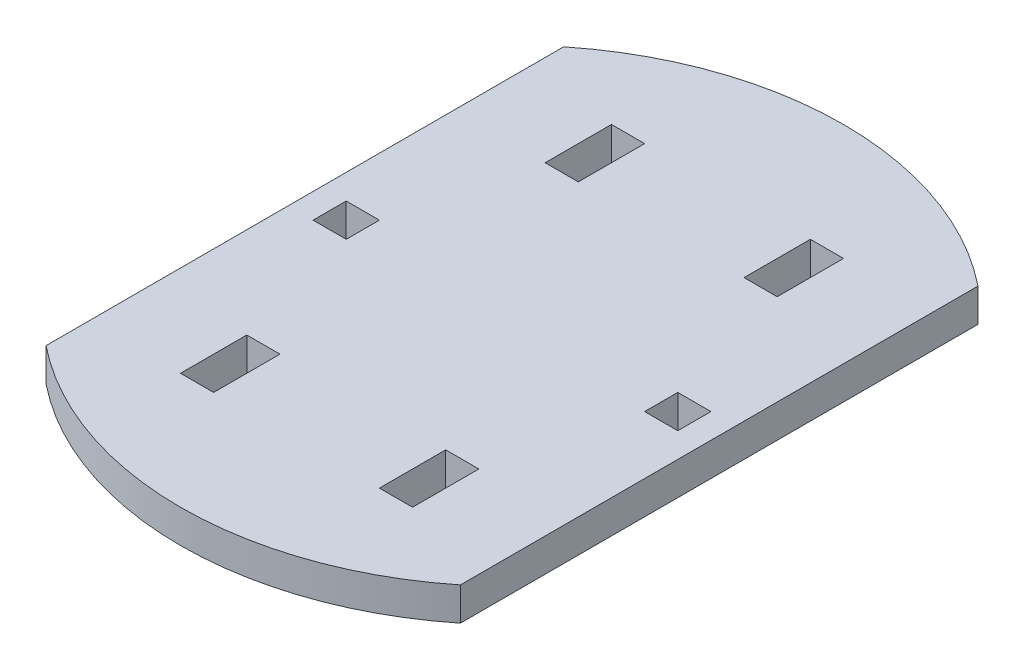
ISO-10303-21;
HEADER;
FILE_DESCRIPTION(('STEP AP214'),'2;1');
FILE_NAME('part.step','',(''),(''),'','','');
FILE_SCHEMA(('AUTOMOTIVE_DESIGN { 1 0 10303 214 1 1 1 1 }'));
ENDSEC;
DATA;
#1=APPLICATION_CONTEXT('core data for automotive mechanical design processes');
#2=APPLICATION_PROTOCOL_DEFINITION('international standard','automotive_design',2000,#1);
#3=PRODUCT_CONTEXT('',#1,'mechanical');
#4=PRODUCT('Part','Part','',(#3));
#5=PRODUCT_RELATED_PRODUCT_CATEGORY('part','',(#4));
#6=PRODUCT_DEFINITION_FORMATION('','',#4);
#7=PRODUCT_DEFINITION_CONTEXT('part definition',#1,'design');
#8=PRODUCT_DEFINITION('design','',#6,#7);
#9=PRODUCT_DEFINITION_SHAPE('','',#8);
#10=(LENGTH_UNIT() NAMED_UNIT(*) SI_UNIT(.MILLI.,.METRE.));
#11=(NAMED_UNIT(*) PLANE_ANGLE_UNIT() SI_UNIT($,.RADIAN.));
#12=(NAMED_UNIT(*) SI_UNIT($,.STERADIAN.) SOLID_ANGLE_UNIT());
#13=UNCERTAINTY_MEASURE_WITH_UNIT(LENGTH_MEASURE(1.E-05),#10,'distance_accuracy_value','');
#14=(GEOMETRIC_REPRESENTATION_CONTEXT(3) GLOBAL_UNCERTAINTY_ASSIGNED_CONTEXT((#13)) GLOBAL_UNIT_ASSIGNED_CONTEXT((#10,
#11,#12)) REPRESENTATION_CONTEXT('',''));
#15=CARTESIAN_POINT('',(0.,0.,0.));
#16=DIRECTION('',(0.,0.,1.));
#17=DIRECTION('',(1.,0.,0.));
#18=AXIS2_PLACEMENT_3D('',#15,#16,#17);
#19=CARTESIAN_POINT('',(25.,4.,0.));
#20=DIRECTION('',(1.,0.,0.));
#21=DIRECTION('',(0.,0.,-1.));
#22=AXIS2_PLACEMENT_3D('',#19,#20,#21);
#23=PLANE('',#22);
#24=DIRECTION('',(0.,0.,1.));
#25=VECTOR('',#24,1.);
#26=CARTESIAN_POINT('',(25.,0.,0.));
#27=LINE('',#26,#25);
#28=CARTESIAN_POINT('',(25.,0.,-31.224989991992));
#29=VERTEX_POINT('',#28);
#30=CARTESIAN_POINT('',(25.,0.,31.224989991992));
#31=VERTEX_POINT('',#30);
#32=EDGE_CURVE('E388',#29,#31,#27,.T.);
#33=ORIENTED_EDGE('',*,*,#32,.F.);
#34=DIRECTION('',(0.,-1.,0.));
#35=VECTOR('',#34,1.);
#36=CARTESIAN_POINT('',(25.,4.,-31.224989991992));
#37=LINE('',#36,#35);
#38=CARTESIAN_POINT('',(25.,4.,-31.224989991992));
#39=VERTEX_POINT('',#38);
#40=EDGE_CURVE('E11',#39,#29,#37,.T.);
#41=ORIENTED_EDGE('',*,*,#40,.F.);
#42=DIRECTION('',(0.,0.,1.));
#43=VECTOR('',#42,1.);
#44=CARTESIAN_POINT('',(25.,4.,0.));
#45=LINE('',#44,#43);
#46=CARTESIAN_POINT('',(25.,4.,31.224989991992));
#47=VERTEX_POINT('',#46);
#48=EDGE_CURVE('E243',#39,#47,#45,.T.);
#49=ORIENTED_EDGE('',*,*,#48,.T.);
#50=DIRECTION('',(0.,-1.,0.));
#51=VECTOR('',#50,1.);
#52=CARTESIAN_POINT('',(25.,4.,31.224989991992));
#53=LINE('',#52,#51);
#54=EDGE_CURVE('E149',#47,#31,#53,.T.);
#55=ORIENTED_EDGE('',*,*,#54,.T.);
#56=EDGE_LOOP('',(#33,#41,#49,#55));
#57=FACE_BOUND('',#56,.T.);
#58=ADVANCED_FACE('F36',(#57),#23,.T.);
#59=CARTESIAN_POINT('',(0.,4.,0.));
#60=DIRECTION('',(0.,-1.,0.));
#61=DIRECTION('',(0.,0.,-1.));
#62=AXIS2_PLACEMENT_3D('',#59,#60,#61);
#63=CYLINDRICAL_SURFACE('',#62,40.);
#64=CARTESIAN_POINT('',(0.,0.,0.));
#65=DIRECTION('',(0.,1.,0.));
#66=DIRECTION('',(0.,0.,1.));
#67=AXIS2_PLACEMENT_3D('',#64,#65,#66);
#68=CIRCLE('',#67,40.);
#69=CARTESIAN_POINT('',(-25.,0.,-31.224989991992));
#70=VERTEX_POINT('',#69);
#71=EDGE_CURVE('E248',#29,#70,#68,.T.);
#72=ORIENTED_EDGE('',*,*,#71,.T.);
#73=DIRECTION('',(0.,-1.,0.));
#74=VECTOR('',#73,1.);
#75=CARTESIAN_POINT('',(-25.,4.,-31.224989991992));
#76=LINE('',#75,#74);
#77=CARTESIAN_POINT('',(-25.,4.,-31.224989991992));
#78=VERTEX_POINT('',#77);
#79=EDGE_CURVE('E46',#78,#70,#76,.T.);
#80=ORIENTED_EDGE('',*,*,#79,.F.);
#81=CARTESIAN_POINT('',(0.,4.,0.));
#82=DIRECTION('',(0.,1.,0.));
#83=DIRECTION('',(0.,0.,1.));
#84=AXIS2_PLACEMENT_3D('',#81,#82,#83);
#85=CIRCLE('',#84,40.);
#86=EDGE_CURVE('E239',#39,#78,#85,.T.);
#87=ORIENTED_EDGE('',*,*,#86,.F.);
#88=ORIENTED_EDGE('',*,*,#40,.T.);
#89=EDGE_LOOP('',(#72,#80,#87,#88));
#90=FACE_BOUND('',#89,.T.);
#91=ADVANCED_FACE('F246',(#90),#63,.T.);
#92=CARTESIAN_POINT('',(-25.,4.,0.));
#93=DIRECTION('',(1.,0.,0.));
#94=DIRECTION('',(0.,0.,-1.));
#95=AXIS2_PLACEMENT_3D('',#92,#93,#94);
#96=PLANE('',#95);
#97=DIRECTION('',(0.,0.,1.));
#98=VECTOR('',#97,1.);
#99=CARTESIAN_POINT('',(-25.,0.,0.));
#100=LINE('',#99,#98);
#101=CARTESIAN_POINT('',(-25.,0.,31.224989991992));
#102=VERTEX_POINT('',#101);
#103=EDGE_CURVE('E391',#70,#102,#100,.T.);
#104=ORIENTED_EDGE('',*,*,#103,.T.);
#105=DIRECTION('',(0.,-1.,0.));
#106=VECTOR('',#105,1.);
#107=CARTESIAN_POINT('',(-25.,4.,31.224989991992));
#108=LINE('',#107,#106);
#109=CARTESIAN_POINT('',(-25.,4.,31.224989991992));
#110=VERTEX_POINT('',#109);
#111=EDGE_CURVE('E238',#110,#102,#108,.T.);
#112=ORIENTED_EDGE('',*,*,#111,.F.);
#113=DIRECTION('',(0.,0.,1.));
#114=VECTOR('',#113,1.);
#115=CARTESIAN_POINT('',(-25.,4.,0.));
#116=LINE('',#115,#114);
#117=EDGE_CURVE('E232',#78,#110,#116,.T.);
#118=ORIENTED_EDGE('',*,*,#117,.F.);
#119=ORIENTED_EDGE('',*,*,#79,.T.);
#120=EDGE_LOOP('',(#104,#112,#118,#119));
#121=FACE_BOUND('',#120,.T.);
#122=ADVANCED_FACE('F235',(#121),#96,.F.);
#123=CARTESIAN_POINT('',(0.,4.,18.));
#124=DIRECTION('',(0.,0.,1.));
#125=DIRECTION('',(1.,0.,0.));
#126=AXIS2_PLACEMENT_3D('',#123,#124,#125);
#127=PLANE('',#126);
#128=DIRECTION('',(-1.,0.,0.));
#129=VECTOR('',#128,1.);
#130=CARTESIAN_POINT('',(0.,0.,18.));
#131=LINE('',#130,#129);
#132=CARTESIAN_POINT('',(14.,0.,18.));
#133=VERTEX_POINT('',#132);
#134=CARTESIAN_POINT('',(10.,0.,18.));
#135=VERTEX_POINT('',#134);
#136=EDGE_CURVE('E376',#133,#135,#131,.T.);
#137=ORIENTED_EDGE('',*,*,#136,.F.);
#138=DIRECTION('',(0.,-1.,0.));
#139=VECTOR('',#138,1.);
#140=CARTESIAN_POINT('',(14.,4.,18.));
#141=LINE('',#140,#139);
#142=CARTESIAN_POINT('',(14.,4.,18.));
#143=VERTEX_POINT('',#142);
#144=EDGE_CURVE('E261',#143,#133,#141,.T.);
#145=ORIENTED_EDGE('',*,*,#144,.F.);
#146=DIRECTION('',(-1.,0.,0.));
#147=VECTOR('',#146,1.);
#148=CARTESIAN_POINT('',(0.,4.,18.));
#149=LINE('',#148,#147);
#150=CARTESIAN_POINT('',(10.,4.,18.));
#151=VERTEX_POINT('',#150);
#152=EDGE_CURVE('E447',#143,#151,#149,.T.);
#153=ORIENTED_EDGE('',*,*,#152,.T.);
#154=DIRECTION('',(0.,-1.,0.));
#155=VECTOR('',#154,1.);
#156=CARTESIAN_POINT('',(10.,4.,18.));
#157=LINE('',#156,#155);
#158=EDGE_CURVE('E253',#151,#135,#157,.T.);
#159=ORIENTED_EDGE('',*,*,#158,.T.);
#160=EDGE_LOOP('',(#137,#145,#153,#159));
#161=FACE_BOUND('',#160,.T.);
#162=ADVANCED_FACE('F488',(#161),#127,.T.);
#163=CARTESIAN_POINT('',(14.,4.,0.));
#164=DIRECTION('',(-1.,0.,0.));
#165=DIRECTION('',(0.,0.,1.));
#166=AXIS2_PLACEMENT_3D('',#163,#164,#165);
#167=PLANE('',#166);
#168=DIRECTION('',(0.,0.,-1.));
#169=VECTOR('',#168,1.);
#170=CARTESIAN_POINT('',(14.,0.,0.));
#171=LINE('',#170,#169);
#172=CARTESIAN_POINT('',(14.,0.,26.));
#173=VERTEX_POINT('',#172);
#174=EDGE_CURVE('E379',#173,#133,#171,.T.);
#175=ORIENTED_EDGE('',*,*,#174,.F.);
#176=DIRECTION('',(0.,-1.,0.));
#177=VECTOR('',#176,1.);
#178=CARTESIAN_POINT('',(14.,4.,26.));
#179=LINE('',#178,#177);
#180=CARTESIAN_POINT('',(14.,4.,26.));
#181=VERTEX_POINT('',#180);
#182=EDGE_CURVE('E259',#181,#173,#179,.T.);
#183=ORIENTED_EDGE('',*,*,#182,.F.);
#184=DIRECTION('',(0.,0.,-1.));
#185=VECTOR('',#184,1.);
#186=CARTESIAN_POINT('',(14.,4.,0.));
#187=LINE('',#186,#185);
#188=EDGE_CURVE('E450',#181,#143,#187,.T.);
#189=ORIENTED_EDGE('',*,*,#188,.T.);
#190=ORIENTED_EDGE('',*,*,#144,.T.);
#191=EDGE_LOOP('',(#175,#183,#189,#190));
#192=FACE_BOUND('',#191,.T.);
#193=ADVANCED_FACE('F484',(#192),#167,.T.);
#194=CARTESIAN_POINT('',(0.,4.,26.));
#195=DIRECTION('',(0.,0.,1.));
#196=DIRECTION('',(1.,0.,0.));
#197=AXIS2_PLACEMENT_3D('',#194,#195,#196);
#198=PLANE('',#197);
#199=DIRECTION('',(-1.,0.,0.));
#200=VECTOR('',#199,1.);
#201=CARTESIAN_POINT('',(0.,0.,26.));
#202=LINE('',#201,#200);
#203=CARTESIAN_POINT('',(10.,0.,26.));
#204=VERTEX_POINT('',#203);
#205=EDGE_CURVE('E382',#173,#204,#202,.T.);
#206=ORIENTED_EDGE('',*,*,#205,.T.);
#207=DIRECTION('',(0.,-1.,0.));
#208=VECTOR('',#207,1.);
#209=CARTESIAN_POINT('',(10.,4.,26.));
#210=LINE('',#209,#208);
#211=CARTESIAN_POINT('',(10.,4.,26.));
#212=VERTEX_POINT('',#211);
#213=EDGE_CURVE('E255',#212,#204,#210,.T.);
#214=ORIENTED_EDGE('',*,*,#213,.F.);
#215=DIRECTION('',(-1.,0.,0.));
#216=VECTOR('',#215,1.);
#217=CARTESIAN_POINT('',(0.,4.,26.));
#218=LINE('',#217,#216);
#219=EDGE_CURVE('E453',#181,#212,#218,.T.);
#220=ORIENTED_EDGE('',*,*,#219,.F.);
#221=ORIENTED_EDGE('',*,*,#182,.T.);
#222=EDGE_LOOP('',(#206,#214,#220,#221));
#223=FACE_BOUND('',#222,.T.);
#224=ADVANCED_FACE('F480',(#223),#198,.F.);
#225=CARTESIAN_POINT('',(0.,4.,-2.));
#226=DIRECTION('',(0.,0.,-1.));
#227=DIRECTION('',(-1.,0.,0.));
#228=AXIS2_PLACEMENT_3D('',#225,#226,#227);
#229=PLANE('',#228);
#230=DIRECTION('',(1.,0.,0.));
#231=VECTOR('',#230,1.);
#232=CARTESIAN_POINT('',(0.,0.,-2.));
#233=LINE('',#232,#231);
#234=CARTESIAN_POINT('',(18.,0.,-2.));
#235=VERTEX_POINT('',#234);
#236=CARTESIAN_POINT('',(22.,0.,-2.));
#237=VERTEX_POINT('',#236);
#238=EDGE_CURVE('E364',#235,#237,#233,.T.);
#239=ORIENTED_EDGE('',*,*,#238,.T.);
#240=DIRECTION('',(0.,-1.,0.));
#241=VECTOR('',#240,1.);
#242=CARTESIAN_POINT('',(22.,4.,-2.));
#243=LINE('',#242,#241);
#244=CARTESIAN_POINT('',(22.,4.,-2.));
#245=VERTEX_POINT('',#244);
#246=EDGE_CURVE('E256',#245,#237,#243,.T.);
#247=ORIENTED_EDGE('',*,*,#246,.F.);
#248=DIRECTION('',(1.,0.,0.));
#249=VECTOR('',#248,1.);
#250=CARTESIAN_POINT('',(0.,4.,-2.));
#251=LINE('',#250,#249);
#252=CARTESIAN_POINT('',(18.,4.,-2.));
#253=VERTEX_POINT('',#252);
#254=EDGE_CURVE('E436',#253,#245,#251,.T.);
#255=ORIENTED_EDGE('',*,*,#254,.F.);
#256=DIRECTION('',(0.,-1.,0.));
#257=VECTOR('',#256,1.);
#258=CARTESIAN_POINT('',(18.,4.,-2.));
#259=LINE('',#258,#257);
#260=EDGE_CURVE('E263',#253,#235,#259,.T.);
#261=ORIENTED_EDGE('',*,*,#260,.T.);
#262=EDGE_LOOP('',(#239,#247,#255,#261));
#263=FACE_BOUND('',#262,.T.);
#264=ADVANCED_FACE('F483',(#263),#229,.F.);
#265=CARTESIAN_POINT('',(22.,4.,0.));
#266=DIRECTION('',(1.,0.,0.));
#267=DIRECTION('',(0.,0.,-1.));
#268=AXIS2_PLACEMENT_3D('',#265,#266,#267);
#269=PLANE('',#268);
#270=DIRECTION('',(0.,0.,1.));
#271=VECTOR('',#270,1.);
#272=CARTESIAN_POINT('',(22.,0.,0.));
#273=LINE('',#272,#271);
#274=CARTESIAN_POINT('',(22.,0.,2.));
#275=VERTEX_POINT('',#274);
#276=EDGE_CURVE('E367',#237,#275,#273,.T.);
#277=ORIENTED_EDGE('',*,*,#276,.T.);
#278=DIRECTION('',(0.,-1.,0.));
#279=VECTOR('',#278,1.);
#280=CARTESIAN_POINT('',(22.,4.,2.));
#281=LINE('',#280,#279);
#282=CARTESIAN_POINT('',(22.,4.,2.));
#283=VERTEX_POINT('',#282);
#284=EDGE_CURVE('E268',#283,#275,#281,.T.);
#285=ORIENTED_EDGE('',*,*,#284,.F.);
#286=DIRECTION('',(0.,0.,1.));
#287=VECTOR('',#286,1.);
#288=CARTESIAN_POINT('',(22.,4.,0.));
#289=LINE('',#288,#287);
#290=EDGE_CURVE('E439',#245,#283,#289,.T.);
#291=ORIENTED_EDGE('',*,*,#290,.F.);
#292=ORIENTED_EDGE('',*,*,#246,.T.);
#293=EDGE_LOOP('',(#277,#285,#291,#292));
#294=FACE_BOUND('',#293,.T.);
#295=ADVANCED_FACE('F501',(#294),#269,.F.);
#296=CARTESIAN_POINT('',(0.,4.,2.));
#297=DIRECTION('',(0.,0.,-1.));
#298=DIRECTION('',(-1.,0.,0.));
#299=AXIS2_PLACEMENT_3D('',#296,#297,#298);
#300=PLANE('',#299);
#301=DIRECTION('',(1.,0.,0.));
#302=VECTOR('',#301,1.);
#303=CARTESIAN_POINT('',(0.,0.,2.));
#304=LINE('',#303,#302);
#305=CARTESIAN_POINT('',(18.,0.,2.));
#306=VERTEX_POINT('',#305);
#307=EDGE_CURVE('E370',#306,#275,#304,.T.);
#308=ORIENTED_EDGE('',*,*,#307,.F.);
#309=DIRECTION('',(0.,-1.,0.));
#310=VECTOR('',#309,1.);
#311=CARTESIAN_POINT('',(18.,4.,2.));
#312=LINE('',#311,#310);
#313=CARTESIAN_POINT('',(18.,4.,2.));
#314=VERTEX_POINT('',#313);
#315=EDGE_CURVE('E265',#314,#306,#312,.T.);
#316=ORIENTED_EDGE('',*,*,#315,.F.);
#317=DIRECTION('',(1.,0.,0.));
#318=VECTOR('',#317,1.);
#319=CARTESIAN_POINT('',(0.,4.,2.));
#320=LINE('',#319,#318);
#321=EDGE_CURVE('E441',#314,#283,#320,.T.);
#322=ORIENTED_EDGE('',*,*,#321,.T.);
#323=ORIENTED_EDGE('',*,*,#284,.T.);
#324=EDGE_LOOP('',(#308,#316,#322,#323));
#325=FACE_BOUND('',#324,.T.);
#326=ADVANCED_FACE('F497',(#325),#300,.T.);
#327=CARTESIAN_POINT('',(0.,4.,-2.));
#328=DIRECTION('',(0.,0.,1.));
#329=DIRECTION('',(1.,0.,0.));
#330=AXIS2_PLACEMENT_3D('',#327,#328,#329);
#331=PLANE('',#330);
#332=DIRECTION('',(-1.,0.,0.));
#333=VECTOR('',#332,1.);
#334=CARTESIAN_POINT('',(0.,0.,-2.));
#335=LINE('',#334,#333);
#336=CARTESIAN_POINT('',(-18.,0.,-2.));
#337=VERTEX_POINT('',#336);
#338=CARTESIAN_POINT('',(-22.,0.,-2.));
#339=VERTEX_POINT('',#338);
#340=EDGE_CURVE('E352',#337,#339,#335,.T.);
#341=ORIENTED_EDGE('',*,*,#340,.F.);
#342=DIRECTION('',(0.,-1.,0.));
#343=VECTOR('',#342,1.);
#344=CARTESIAN_POINT('',(-18.,4.,-2.));
#345=LINE('',#344,#343);
#346=CARTESIAN_POINT('',(-18.,4.,-2.));
#347=VERTEX_POINT('',#346);
#348=EDGE_CURVE('E266',#347,#337,#345,.T.);
#349=ORIENTED_EDGE('',*,*,#348,.F.);
#350=DIRECTION('',(-1.,0.,0.));
#351=VECTOR('',#350,1.);
#352=CARTESIAN_POINT('',(0.,4.,-2.));
#353=LINE('',#352,#351);
#354=CARTESIAN_POINT('',(-22.,4.,-2.));
#355=VERTEX_POINT('',#354);
#356=EDGE_CURVE('E425',#347,#355,#353,.T.);
#357=ORIENTED_EDGE('',*,*,#356,.T.);
#358=DIRECTION('',(0.,-1.,0.));
#359=VECTOR('',#358,1.);
#360=CARTESIAN_POINT('',(-22.,4.,-2.));
#361=LINE('',#360,#359);
#362=EDGE_CURVE('E272',#355,#339,#361,.T.);
#363=ORIENTED_EDGE('',*,*,#362,.T.);
#364=EDGE_LOOP('',(#341,#349,#357,#363));
#365=FACE_BOUND('',#364,.T.);
#366=ADVANCED_FACE('F500',(#365),#331,.T.);
#367=CARTESIAN_POINT('',(-18.,4.,0.));
#368=DIRECTION('',(1.,0.,0.));
#369=DIRECTION('',(0.,0.,-1.));
#370=AXIS2_PLACEMENT_3D('',#367,#368,#369);
#371=PLANE('',#370);
#372=DIRECTION('',(0.,0.,1.));
#373=VECTOR('',#372,1.);
#374=CARTESIAN_POINT('',(-18.,0.,0.));
#375=LINE('',#374,#373);
#376=CARTESIAN_POINT('',(-18.,0.,2.));
#377=VERTEX_POINT('',#376);
#378=EDGE_CURVE('E355',#337,#377,#375,.T.);
#379=ORIENTED_EDGE('',*,*,#378,.T.);
#380=DIRECTION('',(0.,-1.,0.));
#381=VECTOR('',#380,1.);
#382=CARTESIAN_POINT('',(-18.,4.,2.));
#383=LINE('',#382,#381);
#384=CARTESIAN_POINT('',(-18.,4.,2.));
#385=VERTEX_POINT('',#384);
#386=EDGE_CURVE('E277',#385,#377,#383,.T.);
#387=ORIENTED_EDGE('',*,*,#386,.F.);
#388=DIRECTION('',(0.,0.,1.));
#389=VECTOR('',#388,1.);
#390=CARTESIAN_POINT('',(-18.,4.,0.));
#391=LINE('',#390,#389);
#392=EDGE_CURVE('E428',#347,#385,#391,.T.);
#393=ORIENTED_EDGE('',*,*,#392,.F.);
#394=ORIENTED_EDGE('',*,*,#348,.T.);
#395=EDGE_LOOP('',(#379,#387,#393,#394));
#396=FACE_BOUND('',#395,.T.);
#397=ADVANCED_FACE('F517',(#396),#371,.F.);
#398=CARTESIAN_POINT('',(0.,4.,2.));
#399=DIRECTION('',(0.,0.,1.));
#400=DIRECTION('',(1.,0.,0.));
#401=AXIS2_PLACEMENT_3D('',#398,#399,#400);
#402=PLANE('',#401);
#403=DIRECTION('',(-1.,0.,0.));
#404=VECTOR('',#403,1.);
#405=CARTESIAN_POINT('',(0.,0.,2.));
#406=LINE('',#405,#404);
#407=CARTESIAN_POINT('',(-22.,0.,2.));
#408=VERTEX_POINT('',#407);
#409=EDGE_CURVE('E358',#377,#408,#406,.T.);
#410=ORIENTED_EDGE('',*,*,#409,.T.);
#411=DIRECTION('',(0.,-1.,0.));
#412=VECTOR('',#411,1.);
#413=CARTESIAN_POINT('',(-22.,4.,2.));
#414=LINE('',#413,#412);
#415=CARTESIAN_POINT('',(-22.,4.,2.));
#416=VERTEX_POINT('',#415);
#417=EDGE_CURVE('E274',#416,#408,#414,.T.);
#418=ORIENTED_EDGE('',*,*,#417,.F.);
#419=DIRECTION('',(-1.,0.,0.));
#420=VECTOR('',#419,1.);
#421=CARTESIAN_POINT('',(0.,4.,2.));
#422=LINE('',#421,#420);
#423=EDGE_CURVE('E431',#385,#416,#422,.T.);
#424=ORIENTED_EDGE('',*,*,#423,.F.);
#425=ORIENTED_EDGE('',*,*,#386,.T.);
#426=EDGE_LOOP('',(#410,#418,#424,#425));
#427=FACE_BOUND('',#426,.T.);
#428=ADVANCED_FACE('F513',(#427),#402,.F.);
#429=CARTESIAN_POINT('',(0.,4.,-26.));
#430=DIRECTION('',(0.,0.,-1.));
#431=DIRECTION('',(-1.,0.,0.));
#432=AXIS2_PLACEMENT_3D('',#429,#430,#431);
#433=PLANE('',#432);
#434=DIRECTION('',(1.,0.,0.));
#435=VECTOR('',#434,1.);
#436=CARTESIAN_POINT('',(0.,0.,-26.));
#437=LINE('',#436,#435);
#438=CARTESIAN_POINT('',(-14.,0.,-26.));
#439=VERTEX_POINT('',#438);
#440=CARTESIAN_POINT('',(-10.,0.,-26.));
#441=VERTEX_POINT('',#440);
#442=EDGE_CURVE('E340',#439,#441,#437,.T.);
#443=ORIENTED_EDGE('',*,*,#442,.T.);
#444=DIRECTION('',(0.,-1.,0.));
#445=VECTOR('',#444,1.);
#446=CARTESIAN_POINT('',(-10.,4.,-26.));
#447=LINE('',#446,#445);
#448=CARTESIAN_POINT('',(-10.,4.,-26.));
#449=VERTEX_POINT('',#448);
#450=EDGE_CURVE('E275',#449,#441,#447,.T.);
#451=ORIENTED_EDGE('',*,*,#450,.F.);
#452=DIRECTION('',(1.,0.,0.));
#453=VECTOR('',#452,1.);
#454=CARTESIAN_POINT('',(0.,4.,-26.));
#455=LINE('',#454,#453);
#456=CARTESIAN_POINT('',(-14.,4.,-26.));
#457=VERTEX_POINT('',#456);
#458=EDGE_CURVE('E414',#457,#449,#455,.T.);
#459=ORIENTED_EDGE('',*,*,#458,.F.);
#460=DIRECTION('',(0.,-1.,0.));
#461=VECTOR('',#460,1.);
#462=CARTESIAN_POINT('',(-14.,4.,-26.));
#463=LINE('',#462,#461);
#464=EDGE_CURVE('E281',#457,#439,#463,.T.);
#465=ORIENTED_EDGE('',*,*,#464,.T.);
#466=EDGE_LOOP('',(#443,#451,#459,#465));
#467=FACE_BOUND('',#466,.T.);
#468=ADVANCED_FACE('F516',(#467),#433,.F.);
#469=CARTESIAN_POINT('',(-9.99999999999999,4.,0.));
#470=DIRECTION('',(1.,0.,0.));
#471=DIRECTION('',(0.,0.,-1.));
#472=AXIS2_PLACEMENT_3D('',#469,#470,#471);
#473=PLANE('',#472);
#474=DIRECTION('',(0.,0.,1.));
#475=VECTOR('',#474,1.);
#476=CARTESIAN_POINT('',(-9.99999999999999,0.,0.));
#477=LINE('',#476,#475);
#478=CARTESIAN_POINT('',(-10.,0.,-18.));
#479=VERTEX_POINT('',#478);
#480=EDGE_CURVE('E343',#441,#479,#477,.T.);
#481=ORIENTED_EDGE('',*,*,#480,.T.);
#482=DIRECTION('',(0.,-1.,0.));
#483=VECTOR('',#482,1.);
#484=CARTESIAN_POINT('',(-10.,4.,-18.));
#485=LINE('',#484,#483);
#486=CARTESIAN_POINT('',(-10.,4.,-18.));
#487=VERTEX_POINT('',#486);
#488=EDGE_CURVE('E286',#487,#479,#485,.T.);
#489=ORIENTED_EDGE('',*,*,#488,.F.);
#490=DIRECTION('',(0.,0.,1.));
#491=VECTOR('',#490,1.);
#492=CARTESIAN_POINT('',(-9.99999999999999,4.,0.));
#493=LINE('',#492,#491);
#494=EDGE_CURVE('E417',#449,#487,#493,.T.);
#495=ORIENTED_EDGE('',*,*,#494,.F.);
#496=ORIENTED_EDGE('',*,*,#450,.T.);
#497=EDGE_LOOP('',(#481,#489,#495,#496));
#498=FACE_BOUND('',#497,.T.);
#499=ADVANCED_FACE('F533',(#498),#473,.F.);
#500=CARTESIAN_POINT('',(0.,4.,-18.));
#501=DIRECTION('',(0.,0.,-1.));
#502=DIRECTION('',(-1.,0.,0.));
#503=AXIS2_PLACEMENT_3D('',#500,#501,#502);
#504=PLANE('',#503);
#505=DIRECTION('',(1.,0.,0.));
#506=VECTOR('',#505,1.);
#507=CARTESIAN_POINT('',(0.,0.,-18.));
#508=LINE('',#507,#506);
#509=CARTESIAN_POINT('',(-14.,0.,-18.));
#510=VERTEX_POINT('',#509);
#511=EDGE_CURVE('E346',#510,#479,#508,.T.);
#512=ORIENTED_EDGE('',*,*,#511,.F.);
#513=DIRECTION('',(0.,-1.,0.));
#514=VECTOR('',#513,1.);
#515=CARTESIAN_POINT('',(-14.,4.,-18.));
#516=LINE('',#515,#514);
#517=CARTESIAN_POINT('',(-14.,4.,-18.));
#518=VERTEX_POINT('',#517);
#519=EDGE_CURVE('E283',#518,#510,#516,.T.);
#520=ORIENTED_EDGE('',*,*,#519,.F.);
#521=DIRECTION('',(1.,0.,0.));
#522=VECTOR('',#521,1.);
#523=CARTESIAN_POINT('',(0.,4.,-18.));
#524=LINE('',#523,#522);
#525=EDGE_CURVE('E419',#518,#487,#524,.T.);
#526=ORIENTED_EDGE('',*,*,#525,.T.);
#527=ORIENTED_EDGE('',*,*,#488,.T.);
#528=EDGE_LOOP('',(#512,#520,#526,#527));
#529=FACE_BOUND('',#528,.T.);
#530=ADVANCED_FACE('F529',(#529),#504,.T.);
#531=CARTESIAN_POINT('',(0.,4.,-26.));
#532=DIRECTION('',(0.,0.,1.));
#533=DIRECTION('',(1.,0.,0.));
#534=AXIS2_PLACEMENT_3D('',#531,#532,#533);
#535=PLANE('',#534);
#536=DIRECTION('',(-1.,0.,0.));
#537=VECTOR('',#536,1.);
#538=CARTESIAN_POINT('',(0.,0.,-26.));
#539=LINE('',#538,#537);
#540=CARTESIAN_POINT('',(14.,0.,-26.));
#541=VERTEX_POINT('',#540);
#542=CARTESIAN_POINT('',(10.,0.,-26.));
#543=VERTEX_POINT('',#542);
#544=EDGE_CURVE('E328',#541,#543,#539,.T.);
#545=ORIENTED_EDGE('',*,*,#544,.F.);
#546=DIRECTION('',(0.,-1.,0.));
#547=VECTOR('',#546,1.);
#548=CARTESIAN_POINT('',(14.,4.,-26.));
#549=LINE('',#548,#547);
#550=CARTESIAN_POINT('',(14.,4.,-26.));
#551=VERTEX_POINT('',#550);
#552=EDGE_CURVE('E284',#551,#541,#549,.T.);
#553=ORIENTED_EDGE('',*,*,#552,.F.);
#554=DIRECTION('',(-1.,0.,0.));
#555=VECTOR('',#554,1.);
#556=CARTESIAN_POINT('',(0.,4.,-26.));
#557=LINE('',#556,#555);
#558=CARTESIAN_POINT('',(10.,4.,-26.));
#559=VERTEX_POINT('',#558);
#560=EDGE_CURVE('E403',#551,#559,#557,.T.);
#561=ORIENTED_EDGE('',*,*,#560,.T.);
#562=DIRECTION('',(0.,-1.,0.));
#563=VECTOR('',#562,1.);
#564=CARTESIAN_POINT('',(10.,4.,-26.));
#565=LINE('',#564,#563);
#566=EDGE_CURVE('E290',#559,#543,#565,.T.);
#567=ORIENTED_EDGE('',*,*,#566,.T.);
#568=EDGE_LOOP('',(#545,#553,#561,#567));
#569=FACE_BOUND('',#568,.T.);
#570=ADVANCED_FACE('F532',(#569),#535,.T.);
#571=CARTESIAN_POINT('',(14.,4.,0.));
#572=DIRECTION('',(1.,0.,0.));
#573=DIRECTION('',(0.,0.,-1.));
#574=AXIS2_PLACEMENT_3D('',#571,#572,#573);
#575=PLANE('',#574);
#576=DIRECTION('',(0.,0.,1.));
#577=VECTOR('',#576,1.);
#578=CARTESIAN_POINT('',(14.,0.,0.));
#579=LINE('',#578,#577);
#580=CARTESIAN_POINT('',(14.,0.,-18.));
#581=VERTEX_POINT('',#580);
#582=EDGE_CURVE('E331',#541,#581,#579,.T.);
#583=ORIENTED_EDGE('',*,*,#582,.T.);
#584=DIRECTION('',(0.,-1.,0.));
#585=VECTOR('',#584,1.);
#586=CARTESIAN_POINT('',(14.,4.,-18.));
#587=LINE('',#586,#585);
#588=CARTESIAN_POINT('',(14.,4.,-18.));
#589=VERTEX_POINT('',#588);
#590=EDGE_CURVE('E294',#589,#581,#587,.T.);
#591=ORIENTED_EDGE('',*,*,#590,.F.);
#592=DIRECTION('',(0.,0.,1.));
#593=VECTOR('',#592,1.);
#594=CARTESIAN_POINT('',(14.,4.,0.));
#595=LINE('',#594,#593);
#596=EDGE_CURVE('E406',#551,#589,#595,.T.);
#597=ORIENTED_EDGE('',*,*,#596,.F.);
#598=ORIENTED_EDGE('',*,*,#552,.T.);
#599=EDGE_LOOP('',(#583,#591,#597,#598));
#600=FACE_BOUND('',#599,.T.);
#601=ADVANCED_FACE('F548',(#600),#575,.F.);
#602=CARTESIAN_POINT('',(0.,4.,-18.));
#603=DIRECTION('',(0.,0.,1.));
#604=DIRECTION('',(1.,0.,0.));
#605=AXIS2_PLACEMENT_3D('',#602,#603,#604);
#606=PLANE('',#605);
#607=DIRECTION('',(-1.,0.,0.));
#608=VECTOR('',#607,1.);
#609=CARTESIAN_POINT('',(0.,0.,-18.));
#610=LINE('',#609,#608);
#611=CARTESIAN_POINT('',(10.,0.,-18.));
#612=VERTEX_POINT('',#611);
#613=EDGE_CURVE('E334',#581,#612,#610,.T.);
#614=ORIENTED_EDGE('',*,*,#613,.T.);
#615=DIRECTION('',(0.,-1.,0.));
#616=VECTOR('',#615,1.);
#617=CARTESIAN_POINT('',(10.,4.,-18.));
#618=LINE('',#617,#616);
#619=CARTESIAN_POINT('',(10.,4.,-18.));
#620=VERTEX_POINT('',#619);
#621=EDGE_CURVE('E292',#620,#612,#618,.T.);
#622=ORIENTED_EDGE('',*,*,#621,.F.);
#623=DIRECTION('',(-1.,0.,0.));
#624=VECTOR('',#623,1.);
#625=CARTESIAN_POINT('',(0.,4.,-18.));
#626=LINE('',#625,#624);
#627=EDGE_CURVE('E409',#589,#620,#626,.T.);
#628=ORIENTED_EDGE('',*,*,#627,.F.);
#629=ORIENTED_EDGE('',*,*,#590,.T.);
#630=EDGE_LOOP('',(#614,#622,#628,#629));
#631=FACE_BOUND('',#630,.T.);
#632=ADVANCED_FACE('F545',(#631),#606,.F.);
#633=CARTESIAN_POINT('',(0.,4.,26.));
#634=DIRECTION('',(0.,0.,-1.));
#635=DIRECTION('',(-1.,0.,0.));
#636=AXIS2_PLACEMENT_3D('',#633,#634,#635);
#637=PLANE('',#636);
#638=DIRECTION('',(1.,0.,0.));
#639=VECTOR('',#638,1.);
#640=CARTESIAN_POINT('',(0.,0.,26.));
#641=LINE('',#640,#639);
#642=CARTESIAN_POINT('',(-14.,0.,26.));
#643=VERTEX_POINT('',#642);
#644=CARTESIAN_POINT('',(-10.,0.,26.));
#645=VERTEX_POINT('',#644);
#646=EDGE_CURVE('E319',#643,#645,#641,.T.);
#647=ORIENTED_EDGE('',*,*,#646,.F.);
#648=DIRECTION('',(0.,-1.,0.));
#649=VECTOR('',#648,1.);
#650=CARTESIAN_POINT('',(-14.,4.,26.));
#651=LINE('',#650,#649);
#652=CARTESIAN_POINT('',(-14.,4.,26.));
#653=VERTEX_POINT('',#652);
#654=EDGE_CURVE('E40',#653,#643,#651,.T.);
#655=ORIENTED_EDGE('',*,*,#654,.F.);
#656=DIRECTION('',(1.,0.,0.));
#657=VECTOR('',#656,1.);
#658=CARTESIAN_POINT('',(0.,4.,26.));
#659=LINE('',#658,#657);
#660=CARTESIAN_POINT('',(-10.,4.,26.));
#661=VERTEX_POINT('',#660);
#662=EDGE_CURVE('E392',#653,#661,#659,.T.);
#663=ORIENTED_EDGE('',*,*,#662,.T.);
#664=DIRECTION('',(0.,-1.,0.));
#665=VECTOR('',#664,1.);
#666=CARTESIAN_POINT('',(-10.,4.,26.));
#667=LINE('',#666,#665);
#668=EDGE_CURVE('E298',#661,#645,#667,.T.);
#669=ORIENTED_EDGE('',*,*,#668,.T.);
#670=EDGE_LOOP('',(#647,#655,#663,#669));
#671=FACE_BOUND('',#670,.T.);
#672=ADVANCED_FACE('F38',(#671),#637,.T.);
#673=CARTESIAN_POINT('',(-14.,4.,0.));
#674=DIRECTION('',(-1.,0.,0.));
#675=DIRECTION('',(0.,0.,1.));
#676=AXIS2_PLACEMENT_3D('',#673,#674,#675);
#677=PLANE('',#676);
#678=DIRECTION('',(0.,0.,-1.));
#679=VECTOR('',#678,1.);
#680=CARTESIAN_POINT('',(-14.,0.,0.));
#681=LINE('',#680,#679);
#682=CARTESIAN_POINT('',(-14.,0.,18.));
#683=VERTEX_POINT('',#682);
#684=EDGE_CURVE('E311',#643,#683,#681,.T.);
#685=ORIENTED_EDGE('',*,*,#684,.T.);
#686=DIRECTION('',(0.,-1.,0.));
#687=VECTOR('',#686,1.);
#688=CARTESIAN_POINT('',(-14.,4.,18.));
#689=LINE('',#688,#687);
#690=CARTESIAN_POINT('',(-14.,4.,18.));
#691=VERTEX_POINT('',#690);
#692=EDGE_CURVE('E301',#691,#683,#689,.T.);
#693=ORIENTED_EDGE('',*,*,#692,.F.);
#694=DIRECTION('',(0.,0.,-1.));
#695=VECTOR('',#694,1.);
#696=CARTESIAN_POINT('',(-14.,4.,0.));
#697=LINE('',#696,#695);
#698=EDGE_CURVE('E312',#653,#691,#697,.T.);
#699=ORIENTED_EDGE('',*,*,#698,.F.);
#700=ORIENTED_EDGE('',*,*,#654,.T.);
#701=EDGE_LOOP('',(#685,#693,#699,#700));
#702=FACE_BOUND('',#701,.T.);
#703=ADVANCED_FACE('F310',(#702),#677,.F.);
#704=CARTESIAN_POINT('',(0.,4.,18.));
#705=DIRECTION('',(0.,0.,-1.));
#706=DIRECTION('',(-1.,0.,0.));
#707=AXIS2_PLACEMENT_3D('',#704,#705,#706);
#708=PLANE('',#707);
#709=DIRECTION('',(1.,0.,0.));
#710=VECTOR('',#709,1.);
#711=CARTESIAN_POINT('',(0.,0.,18.));
#712=LINE('',#711,#710);
#713=CARTESIAN_POINT('',(-10.,0.,18.));
#714=VERTEX_POINT('',#713);
#715=EDGE_CURVE('E321',#683,#714,#712,.T.);
#716=ORIENTED_EDGE('',*,*,#715,.T.);
#717=DIRECTION('',(0.,-1.,0.));
#718=VECTOR('',#717,1.);
#719=CARTESIAN_POINT('',(-10.,4.,18.));
#720=LINE('',#719,#718);
#721=CARTESIAN_POINT('',(-10.,4.,18.));
#722=VERTEX_POINT('',#721);
#723=EDGE_CURVE('E300',#722,#714,#720,.T.);
#724=ORIENTED_EDGE('',*,*,#723,.F.);
#725=DIRECTION('',(1.,0.,0.));
#726=VECTOR('',#725,1.);
#727=CARTESIAN_POINT('',(0.,4.,18.));
#728=LINE('',#727,#726);
#729=EDGE_CURVE('E396',#691,#722,#728,.T.);
#730=ORIENTED_EDGE('',*,*,#729,.F.);
#731=ORIENTED_EDGE('',*,*,#692,.T.);
#732=EDGE_LOOP('',(#716,#724,#730,#731));
#733=FACE_BOUND('',#732,.T.);
#734=ADVANCED_FACE('F478',(#733),#708,.F.);
#735=CARTESIAN_POINT('',(9.99999999999999,4.,0.));
#736=DIRECTION('',(-1.,0.,0.));
#737=DIRECTION('',(0.,0.,1.));
#738=AXIS2_PLACEMENT_3D('',#735,#736,#737);
#739=PLANE('',#738);
#740=DIRECTION('',(0.,0.,-1.));
#741=VECTOR('',#740,1.);
#742=CARTESIAN_POINT('',(9.99999999999999,0.,0.));
#743=LINE('',#742,#741);
#744=EDGE_CURVE('E385',#204,#135,#743,.T.);
#745=ORIENTED_EDGE('',*,*,#744,.T.);
#746=ORIENTED_EDGE('',*,*,#158,.F.);
#747=DIRECTION('',(0.,0.,-1.));
#748=VECTOR('',#747,1.);
#749=CARTESIAN_POINT('',(9.99999999999999,4.,0.));
#750=LINE('',#749,#748);
#751=EDGE_CURVE('E456',#212,#151,#750,.T.);
#752=ORIENTED_EDGE('',*,*,#751,.F.);
#753=ORIENTED_EDGE('',*,*,#213,.T.);
#754=EDGE_LOOP('',(#745,#746,#752,#753));
#755=FACE_BOUND('',#754,.T.);
#756=ADVANCED_FACE('F474',(#755),#739,.F.);
#757=CARTESIAN_POINT('',(18.,4.,0.));
#758=DIRECTION('',(1.,0.,0.));
#759=DIRECTION('',(0.,0.,-1.));
#760=AXIS2_PLACEMENT_3D('',#757,#758,#759);
#761=PLANE('',#760);
#762=DIRECTION('',(0.,0.,1.));
#763=VECTOR('',#762,1.);
#764=CARTESIAN_POINT('',(18.,0.,0.));
#765=LINE('',#764,#763);
#766=EDGE_CURVE('E373',#235,#306,#765,.T.);
#767=ORIENTED_EDGE('',*,*,#766,.F.);
#768=ORIENTED_EDGE('',*,*,#260,.F.);
#769=DIRECTION('',(0.,0.,1.));
#770=VECTOR('',#769,1.);
#771=CARTESIAN_POINT('',(18.,4.,0.));
#772=LINE('',#771,#770);
#773=EDGE_CURVE('E444',#253,#314,#772,.T.);
#774=ORIENTED_EDGE('',*,*,#773,.T.);
#775=ORIENTED_EDGE('',*,*,#315,.T.);
#776=EDGE_LOOP('',(#767,#768,#774,#775));
#777=FACE_BOUND('',#776,.T.);
#778=ADVANCED_FACE('F477',(#777),#761,.T.);
#779=CARTESIAN_POINT('',(-22.,4.,0.));
#780=DIRECTION('',(1.,0.,0.));
#781=DIRECTION('',(0.,0.,-1.));
#782=AXIS2_PLACEMENT_3D('',#779,#780,#781);
#783=PLANE('',#782);
#784=DIRECTION('',(0.,0.,1.));
#785=VECTOR('',#784,1.);
#786=CARTESIAN_POINT('',(-22.,0.,0.));
#787=LINE('',#786,#785);
#788=EDGE_CURVE('E361',#339,#408,#787,.T.);
#789=ORIENTED_EDGE('',*,*,#788,.F.);
#790=ORIENTED_EDGE('',*,*,#362,.F.);
#791=DIRECTION('',(0.,0.,1.));
#792=VECTOR('',#791,1.);
#793=CARTESIAN_POINT('',(-22.,4.,0.));
#794=LINE('',#793,#792);
#795=EDGE_CURVE('E433',#355,#416,#794,.T.);
#796=ORIENTED_EDGE('',*,*,#795,.T.);
#797=ORIENTED_EDGE('',*,*,#417,.T.);
#798=EDGE_LOOP('',(#789,#790,#796,#797));
#799=FACE_BOUND('',#798,.T.);
#800=ADVANCED_FACE('F495',(#799),#783,.T.);
#801=CARTESIAN_POINT('',(-14.,4.,0.));
#802=DIRECTION('',(1.,0.,0.));
#803=DIRECTION('',(0.,0.,-1.));
#804=AXIS2_PLACEMENT_3D('',#801,#802,#803);
#805=PLANE('',#804);
#806=DIRECTION('',(0.,0.,1.));
#807=VECTOR('',#806,1.);
#808=CARTESIAN_POINT('',(-14.,0.,0.));
#809=LINE('',#808,#807);
#810=EDGE_CURVE('E349',#439,#510,#809,.T.);
#811=ORIENTED_EDGE('',*,*,#810,.F.);
#812=ORIENTED_EDGE('',*,*,#464,.F.);
#813=DIRECTION('',(0.,0.,1.));
#814=VECTOR('',#813,1.);
#815=CARTESIAN_POINT('',(-14.,4.,0.));
#816=LINE('',#815,#814);
#817=EDGE_CURVE('E422',#457,#518,#816,.T.);
#818=ORIENTED_EDGE('',*,*,#817,.T.);
#819=ORIENTED_EDGE('',*,*,#519,.T.);
#820=EDGE_LOOP('',(#811,#812,#818,#819));
#821=FACE_BOUND('',#820,.T.);
#822=ADVANCED_FACE('F511',(#821),#805,.T.);
#823=CARTESIAN_POINT('',(9.99999999999999,4.,0.));
#824=DIRECTION('',(1.,0.,0.));
#825=DIRECTION('',(0.,0.,-1.));
#826=AXIS2_PLACEMENT_3D('',#823,#824,#825);
#827=PLANE('',#826);
#828=DIRECTION('',(0.,0.,1.));
#829=VECTOR('',#828,1.);
#830=CARTESIAN_POINT('',(9.99999999999999,0.,0.));
#831=LINE('',#830,#829);
#832=EDGE_CURVE('E337',#543,#612,#831,.T.);
#833=ORIENTED_EDGE('',*,*,#832,.F.);
#834=ORIENTED_EDGE('',*,*,#566,.F.);
#835=DIRECTION('',(0.,0.,1.));
#836=VECTOR('',#835,1.);
#837=CARTESIAN_POINT('',(9.99999999999999,4.,0.));
#838=LINE('',#837,#836);
#839=EDGE_CURVE('E411',#559,#620,#838,.T.);
#840=ORIENTED_EDGE('',*,*,#839,.T.);
#841=ORIENTED_EDGE('',*,*,#621,.T.);
#842=EDGE_LOOP('',(#833,#834,#840,#841));
#843=FACE_BOUND('',#842,.T.);
#844=ADVANCED_FACE('F527',(#843),#827,.T.);
#845=CARTESIAN_POINT('',(-9.99999999999999,4.,0.));
#846=DIRECTION('',(-1.,0.,0.));
#847=DIRECTION('',(0.,0.,1.));
#848=AXIS2_PLACEMENT_3D('',#845,#846,#847);
#849=PLANE('',#848);
#850=DIRECTION('',(0.,0.,-1.));
#851=VECTOR('',#850,1.);
#852=CARTESIAN_POINT('',(-9.99999999999999,0.,0.));
#853=LINE('',#852,#851);
#854=EDGE_CURVE('E326',#645,#714,#853,.T.);
#855=ORIENTED_EDGE('',*,*,#854,.F.);
#856=ORIENTED_EDGE('',*,*,#668,.F.);
#857=DIRECTION('',(0.,0.,-1.));
#858=VECTOR('',#857,1.);
#859=CARTESIAN_POINT('',(-9.99999999999999,4.,0.));
#860=LINE('',#859,#858);
#861=EDGE_CURVE('E400',#661,#722,#860,.T.);
#862=ORIENTED_EDGE('',*,*,#861,.T.);
#863=ORIENTED_EDGE('',*,*,#723,.T.);
#864=EDGE_LOOP('',(#855,#856,#862,#863));
#865=FACE_BOUND('',#864,.T.);
#866=ADVANCED_FACE('F543',(#865),#849,.T.);
#867=EDGE_CURVE('E142',#102,#31,#68,.T.);
#868=ORIENTED_EDGE('',*,*,#867,.T.);
#869=ORIENTED_EDGE('',*,*,#54,.F.);
#870=EDGE_CURVE('E55',#110,#47,#85,.T.);
#871=ORIENTED_EDGE('',*,*,#870,.F.);
#872=ORIENTED_EDGE('',*,*,#111,.T.);
#873=EDGE_LOOP('',(#868,#869,#871,#872));
#874=FACE_BOUND('',#873,.T.);
#875=ADVANCED_FACE('F463',(#874),#63,.T.);
#876=CARTESIAN_POINT('',(0.,4.,0.));
#877=DIRECTION('',(0.,1.,0.));
#878=DIRECTION('',(0.,0.,1.));
#879=AXIS2_PLACEMENT_3D('',#876,#877,#878);
#880=PLANE('',#879);
#881=ORIENTED_EDGE('',*,*,#662,.F.);
#882=ORIENTED_EDGE('',*,*,#698,.T.);
#883=ORIENTED_EDGE('',*,*,#729,.T.);
#884=ORIENTED_EDGE('',*,*,#861,.F.);
#885=EDGE_LOOP('',(#881,#882,#883,#884));
#886=FACE_BOUND('',#885,.T.);
#887=ORIENTED_EDGE('',*,*,#560,.F.);
#888=ORIENTED_EDGE('',*,*,#596,.T.);
#889=ORIENTED_EDGE('',*,*,#627,.T.);
#890=ORIENTED_EDGE('',*,*,#839,.F.);
#891=EDGE_LOOP('',(#887,#888,#889,#890));
#892=FACE_BOUND('',#891,.T.);
#893=ORIENTED_EDGE('',*,*,#458,.T.);
#894=ORIENTED_EDGE('',*,*,#494,.T.);
#895=ORIENTED_EDGE('',*,*,#525,.F.);
#896=ORIENTED_EDGE('',*,*,#817,.F.);
#897=EDGE_LOOP('',(#893,#894,#895,#896));
#898=FACE_BOUND('',#897,.T.);
#899=ORIENTED_EDGE('',*,*,#356,.F.);
#900=ORIENTED_EDGE('',*,*,#392,.T.);
#901=ORIENTED_EDGE('',*,*,#423,.T.);
#902=ORIENTED_EDGE('',*,*,#795,.F.);
#903=EDGE_LOOP('',(#899,#900,#901,#902));
#904=FACE_BOUND('',#903,.T.);
#905=ORIENTED_EDGE('',*,*,#254,.T.);
#906=ORIENTED_EDGE('',*,*,#290,.T.);
#907=ORIENTED_EDGE('',*,*,#321,.F.);
#908=ORIENTED_EDGE('',*,*,#773,.F.);
#909=EDGE_LOOP('',(#905,#906,#907,#908));
#910=FACE_BOUND('',#909,.T.);
#911=ORIENTED_EDGE('',*,*,#152,.F.);
#912=ORIENTED_EDGE('',*,*,#188,.F.);
#913=ORIENTED_EDGE('',*,*,#219,.T.);
#914=ORIENTED_EDGE('',*,*,#751,.T.);
#915=EDGE_LOOP('',(#911,#912,#913,#914));
#916=FACE_BOUND('',#915,.T.);
#917=ORIENTED_EDGE('',*,*,#48,.F.);
#918=ORIENTED_EDGE('',*,*,#86,.T.);
#919=ORIENTED_EDGE('',*,*,#117,.T.);
#920=ORIENTED_EDGE('',*,*,#870,.T.);
#921=EDGE_LOOP('',(#917,#918,#919,#920));
#922=FACE_BOUND('',#921,.T.);
#923=ADVANCED_FACE('F242',(#886,#892,#898,#904,#910,#916,#922),#880,.T.);
#924=CARTESIAN_POINT('',(0.,0.,0.));
#925=DIRECTION('',(0.,1.,0.));
#926=DIRECTION('',(0.,0.,1.));
#927=AXIS2_PLACEMENT_3D('',#924,#925,#926);
#928=PLANE('',#927);
#929=ORIENTED_EDGE('',*,*,#646,.T.);
#930=ORIENTED_EDGE('',*,*,#854,.T.);
#931=ORIENTED_EDGE('',*,*,#715,.F.);
#932=ORIENTED_EDGE('',*,*,#684,.F.);
#933=EDGE_LOOP('',(#929,#930,#931,#932));
#934=FACE_BOUND('',#933,.T.);
#935=ORIENTED_EDGE('',*,*,#544,.T.);
#936=ORIENTED_EDGE('',*,*,#832,.T.);
#937=ORIENTED_EDGE('',*,*,#613,.F.);
#938=ORIENTED_EDGE('',*,*,#582,.F.);
#939=EDGE_LOOP('',(#935,#936,#937,#938));
#940=FACE_BOUND('',#939,.T.);
#941=ORIENTED_EDGE('',*,*,#442,.F.);
#942=ORIENTED_EDGE('',*,*,#810,.T.);
#943=ORIENTED_EDGE('',*,*,#511,.T.);
#944=ORIENTED_EDGE('',*,*,#480,.F.);
#945=EDGE_LOOP('',(#941,#942,#943,#944));
#946=FACE_BOUND('',#945,.T.);
#947=ORIENTED_EDGE('',*,*,#340,.T.);
#948=ORIENTED_EDGE('',*,*,#788,.T.);
#949=ORIENTED_EDGE('',*,*,#409,.F.);
#950=ORIENTED_EDGE('',*,*,#378,.F.);
#951=EDGE_LOOP('',(#947,#948,#949,#950));
#952=FACE_BOUND('',#951,.T.);
#953=ORIENTED_EDGE('',*,*,#238,.F.);
#954=ORIENTED_EDGE('',*,*,#766,.T.);
#955=ORIENTED_EDGE('',*,*,#307,.T.);
#956=ORIENTED_EDGE('',*,*,#276,.F.);
#957=EDGE_LOOP('',(#953,#954,#955,#956));
#958=FACE_BOUND('',#957,.T.);
#959=ORIENTED_EDGE('',*,*,#136,.T.);
#960=ORIENTED_EDGE('',*,*,#744,.F.);
#961=ORIENTED_EDGE('',*,*,#205,.F.);
#962=ORIENTED_EDGE('',*,*,#174,.T.);
#963=EDGE_LOOP('',(#959,#960,#961,#962));
#964=FACE_BOUND('',#963,.T.);
#965=ORIENTED_EDGE('',*,*,#32,.T.);
#966=ORIENTED_EDGE('',*,*,#867,.F.);
#967=ORIENTED_EDGE('',*,*,#103,.F.);
#968=ORIENTED_EDGE('',*,*,#71,.F.);
#969=EDGE_LOOP('',(#965,#966,#967,#968));
#970=FACE_BOUND('',#969,.T.);
#971=ADVANCED_FACE('F316',(#934,#940,#946,#952,#958,#964,#970),#928,.F.);
#972=CLOSED_SHELL('',(#58,#91,#122,#162,#193,#224,#264,#295,#326,#366,#397,#428,#468,#499,#530,
#570,#601,#632,#672,#703,#734,#756,#778,#800,#822,#844,#866,#875,#923,#971));
#973=MANIFOLD_SOLID_BREP('B2',#972);
#974=ADVANCED_BREP_SHAPE_REPRESENTATION('',(#18,#973),#14);
#975=SHAPE_DEFINITION_REPRESENTATION(#9,#974);
ENDSEC;
END-ISO-10303-21;
